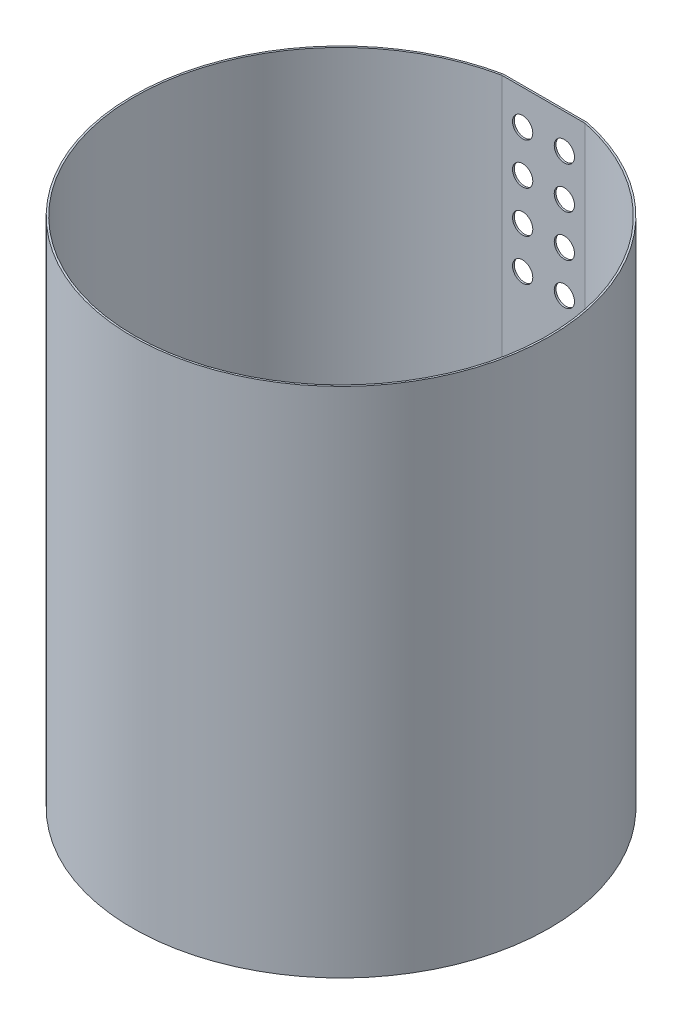
ISO-10303-21;
HEADER;
FILE_DESCRIPTION(('STEP AP214'),'2;1');
FILE_NAME('part.step','',(''),(''),'','','');
FILE_SCHEMA(('AUTOMOTIVE_DESIGN { 1 0 10303 214 1 1 1 1 }'));
ENDSEC;
DATA;
#1=APPLICATION_CONTEXT('core data for automotive mechanical design processes');
#2=APPLICATION_PROTOCOL_DEFINITION('international standard','automotive_design',2000,#1);
#3=PRODUCT_CONTEXT('',#1,'mechanical');
#4=PRODUCT('Part','Part','',(#3));
#5=PRODUCT_RELATED_PRODUCT_CATEGORY('part','',(#4));
#6=PRODUCT_DEFINITION_FORMATION('','',#4);
#7=PRODUCT_DEFINITION_CONTEXT('part definition',#1,'design');
#8=PRODUCT_DEFINITION('design','',#6,#7);
#9=PRODUCT_DEFINITION_SHAPE('','',#8);
#10=(LENGTH_UNIT() NAMED_UNIT(*) SI_UNIT(.MILLI.,.METRE.));
#11=(NAMED_UNIT(*) PLANE_ANGLE_UNIT() SI_UNIT($,.RADIAN.));
#12=(NAMED_UNIT(*) SI_UNIT($,.STERADIAN.) SOLID_ANGLE_UNIT());
#13=UNCERTAINTY_MEASURE_WITH_UNIT(LENGTH_MEASURE(1.E-05),#10,'distance_accuracy_value','');
#14=(GEOMETRIC_REPRESENTATION_CONTEXT(3) GLOBAL_UNCERTAINTY_ASSIGNED_CONTEXT((#13)) GLOBAL_UNIT_ASSIGNED_CONTEXT((#10,
#11,#12)) REPRESENTATION_CONTEXT('',''));
#15=CARTESIAN_POINT('',(0.,0.,0.));
#16=DIRECTION('',(0.,0.,1.));
#17=DIRECTION('',(1.,0.,0.));
#18=AXIS2_PLACEMENT_3D('',#15,#16,#17);
#19=CARTESIAN_POINT('',(0.,430.,-171.43307506192));
#20=DIRECTION('',(0.,0.,-1.));
#21=DIRECTION('',(-1.,0.,0.));
#22=AXIS2_PLACEMENT_3D('',#19,#20,#21);
#23=PLANE('',#22);
#24=CARTESIAN_POINT('',(17.5,296.,-171.43307506192));
#25=DIRECTION('',(0.,0.,-1.));
#26=DIRECTION('',(-1.,0.,0.));
#27=AXIS2_PLACEMENT_3D('',#24,#25,#26);
#28=CIRCLE('',#27,8.50000000000002);
#29=CARTESIAN_POINT('',(8.99999999999998,296.,-171.43307506192));
#30=VERTEX_POINT('',#29);
#31=EDGE_CURVE('E191',#30,#30,#28,.T.);
#32=ORIENTED_EDGE('',*,*,#31,.F.);
#33=EDGE_LOOP('',(#32));
#34=FACE_BOUND('',#33,.T.);
#35=CARTESIAN_POINT('',(-17.5,331.,-171.43307506192));
#36=DIRECTION('',(0.,0.,-1.));
#37=DIRECTION('',(1.,0.,0.));
#38=AXIS2_PLACEMENT_3D('',#35,#36,#37);
#39=CIRCLE('',#38,8.50000000000002);
#40=CARTESIAN_POINT('',(-8.99999999999999,331.,-171.43307506192));
#41=VERTEX_POINT('',#40);
#42=EDGE_CURVE('E195',#41,#41,#39,.T.);
#43=ORIENTED_EDGE('',*,*,#42,.F.);
#44=EDGE_LOOP('',(#43));
#45=FACE_BOUND('',#44,.T.);
#46=CARTESIAN_POINT('',(17.5,331.,-171.43307506192));
#47=DIRECTION('',(0.,0.,-1.));
#48=DIRECTION('',(-1.,0.,0.));
#49=AXIS2_PLACEMENT_3D('',#46,#47,#48);
#50=CIRCLE('',#49,8.50000000000002);
#51=CARTESIAN_POINT('',(8.99999999999998,331.,-171.43307506192));
#52=VERTEX_POINT('',#51);
#53=EDGE_CURVE('E183',#52,#52,#50,.T.);
#54=ORIENTED_EDGE('',*,*,#53,.F.);
#55=EDGE_LOOP('',(#54));
#56=FACE_BOUND('',#55,.T.);
#57=CARTESIAN_POINT('',(-17.5,366.,-171.43307506192));
#58=DIRECTION('',(0.,0.,-1.));
#59=DIRECTION('',(1.,0.,0.));
#60=AXIS2_PLACEMENT_3D('',#57,#58,#59);
#61=CIRCLE('',#60,8.50000000000002);
#62=CARTESIAN_POINT('',(-8.99999999999999,366.,-171.43307506192));
#63=VERTEX_POINT('',#62);
#64=EDGE_CURVE('E187',#63,#63,#61,.T.);
#65=ORIENTED_EDGE('',*,*,#64,.F.);
#66=EDGE_LOOP('',(#65));
#67=FACE_BOUND('',#66,.T.);
#68=CARTESIAN_POINT('',(-17.5,296.,-171.43307506192));
#69=DIRECTION('',(0.,0.,-1.));
#70=DIRECTION('',(1.,0.,0.));
#71=AXIS2_PLACEMENT_3D('',#68,#69,#70);
#72=CIRCLE('',#71,8.50000000000002);
#73=CARTESIAN_POINT('',(-8.99999999999999,296.,-171.43307506192));
#74=VERTEX_POINT('',#73);
#75=EDGE_CURVE('E199',#74,#74,#72,.T.);
#76=ORIENTED_EDGE('',*,*,#75,.F.);
#77=EDGE_LOOP('',(#76));
#78=FACE_BOUND('',#77,.T.);
#79=CARTESIAN_POINT('',(17.5,366.,-171.43307506192));
#80=DIRECTION('',(0.,0.,-1.));
#81=DIRECTION('',(-1.,0.,0.));
#82=AXIS2_PLACEMENT_3D('',#79,#80,#81);
#83=CIRCLE('',#82,8.50000000000002);
#84=CARTESIAN_POINT('',(8.99999999999998,366.,-171.43307506192));
#85=VERTEX_POINT('',#84);
#86=EDGE_CURVE('E179',#85,#85,#83,.T.);
#87=ORIENTED_EDGE('',*,*,#86,.F.);
#88=EDGE_LOOP('',(#87));
#89=FACE_BOUND('',#88,.T.);
#90=CARTESIAN_POINT('',(17.5,401.,-171.43307506192));
#91=DIRECTION('',(0.,0.,-1.));
#92=DIRECTION('',(-1.,0.,0.));
#93=AXIS2_PLACEMENT_3D('',#90,#91,#92);
#94=CIRCLE('',#93,8.50000000000002);
#95=CARTESIAN_POINT('',(8.99999999999998,401.,-171.43307506192));
#96=VERTEX_POINT('',#95);
#97=EDGE_CURVE('E173',#96,#96,#94,.T.);
#98=ORIENTED_EDGE('',*,*,#97,.F.);
#99=EDGE_LOOP('',(#98));
#100=FACE_BOUND('',#99,.T.);
#101=CARTESIAN_POINT('',(-17.5,401.,-171.43307506192));
#102=DIRECTION('',(0.,0.,-1.));
#103=DIRECTION('',(1.,0.,0.));
#104=AXIS2_PLACEMENT_3D('',#101,#102,#103);
#105=CIRCLE('',#104,8.50000000000002);
#106=CARTESIAN_POINT('',(-8.99999999999999,401.,-171.43307506192));
#107=VERTEX_POINT('',#106);
#108=EDGE_CURVE('E105',#107,#107,#105,.T.);
#109=ORIENTED_EDGE('',*,*,#108,.F.);
#110=EDGE_LOOP('',(#109));
#111=FACE_BOUND('',#110,.T.);
#112=DIRECTION('',(1.,0.,0.));
#113=VECTOR('',#112,1.);
#114=CARTESIAN_POINT('',(0.,0.,-171.43307506192));
#115=LINE('',#114,#113);
#116=CARTESIAN_POINT('',(-35.1525358233832,0.,-171.43307506192));
#117=VERTEX_POINT('',#116);
#118=CARTESIAN_POINT('',(35.1525358233832,0.,-171.43307506192));
#119=VERTEX_POINT('',#118);
#120=EDGE_CURVE('E102',#117,#119,#115,.T.);
#121=ORIENTED_EDGE('',*,*,#120,.F.);
#122=DIRECTION('',(0.,-1.,0.));
#123=VECTOR('',#122,1.);
#124=CARTESIAN_POINT('',(-35.1525358233832,430.,-171.43307506192));
#125=LINE('',#124,#123);
#126=CARTESIAN_POINT('',(-35.1525358233832,430.,-171.43307506192));
#127=VERTEX_POINT('',#126);
#128=EDGE_CURVE('E11',#127,#117,#125,.T.);
#129=ORIENTED_EDGE('',*,*,#128,.F.);
#130=DIRECTION('',(1.,0.,0.));
#131=VECTOR('',#130,1.);
#132=CARTESIAN_POINT('',(0.,430.,-171.43307506192));
#133=LINE('',#132,#131);
#134=CARTESIAN_POINT('',(35.1525358233832,430.,-171.43307506192));
#135=VERTEX_POINT('',#134);
#136=EDGE_CURVE('E92',#127,#135,#133,.T.);
#137=ORIENTED_EDGE('',*,*,#136,.T.);
#138=DIRECTION('',(0.,-1.,0.));
#139=VECTOR('',#138,1.);
#140=CARTESIAN_POINT('',(35.1525358233832,430.,-171.43307506192));
#141=LINE('',#140,#139);
#142=EDGE_CURVE('E49',#135,#119,#141,.T.);
#143=ORIENTED_EDGE('',*,*,#142,.T.);
#144=EDGE_LOOP('',(#121,#129,#137,#143));
#145=FACE_BOUND('',#144,.T.);
#146=ADVANCED_FACE('F39',(#34,#45,#56,#67,#78,#89,#100,#111,#145),#23,.T.);
#147=CARTESIAN_POINT('',(0.,430.,0.));
#148=DIRECTION('',(0.,-1.,0.));
#149=DIRECTION('',(0.,0.,-1.));
#150=AXIS2_PLACEMENT_3D('',#147,#148,#149);
#151=CYLINDRICAL_SURFACE('',#150,173.5);
#152=CARTESIAN_POINT('',(0.,0.,0.));
#153=DIRECTION('',(0.,1.,0.));
#154=DIRECTION('',(0.,0.,1.));
#155=AXIS2_PLACEMENT_3D('',#152,#153,#154);
#156=CIRCLE('',#155,173.5);
#157=CARTESIAN_POINT('',(-35.,0.,-169.93307506192));
#158=VERTEX_POINT('',#157);
#159=CARTESIAN_POINT('',(35.,0.,-169.93307506192));
#160=VERTEX_POINT('',#159);
#161=EDGE_CURVE('E110',#158,#160,#156,.T.);
#162=ORIENTED_EDGE('',*,*,#161,.F.);
#163=DIRECTION('',(0.,-1.,0.));
#164=VECTOR('',#163,1.);
#165=CARTESIAN_POINT('',(-35.,430.,-169.93307506192));
#166=LINE('',#165,#164);
#167=CARTESIAN_POINT('',(-35.,430.,-169.93307506192));
#168=VERTEX_POINT('',#167);
#169=EDGE_CURVE('E43',#168,#158,#166,.T.);
#170=ORIENTED_EDGE('',*,*,#169,.F.);
#171=CARTESIAN_POINT('',(0.,430.,0.));
#172=DIRECTION('',(0.,1.,0.));
#173=DIRECTION('',(0.,0.,1.));
#174=AXIS2_PLACEMENT_3D('',#171,#172,#173);
#175=CIRCLE('',#174,173.5);
#176=CARTESIAN_POINT('',(35.,430.,-169.93307506192));
#177=VERTEX_POINT('',#176);
#178=EDGE_CURVE('E90',#168,#177,#175,.T.);
#179=ORIENTED_EDGE('',*,*,#178,.T.);
#180=DIRECTION('',(0.,-1.,0.));
#181=VECTOR('',#180,1.);
#182=CARTESIAN_POINT('',(35.,430.,-169.93307506192));
#183=LINE('',#182,#181);
#184=EDGE_CURVE('E95',#177,#160,#183,.T.);
#185=ORIENTED_EDGE('',*,*,#184,.T.);
#186=EDGE_LOOP('',(#162,#170,#179,#185));
#187=FACE_BOUND('',#186,.T.);
#188=ADVANCED_FACE('F41',(#187),#151,.F.);
#189=CARTESIAN_POINT('',(0.,430.,-169.93307506192));
#190=DIRECTION('',(0.,0.,-1.));
#191=DIRECTION('',(-1.,0.,0.));
#192=AXIS2_PLACEMENT_3D('',#189,#190,#191);
#193=PLANE('',#192);
#194=CARTESIAN_POINT('',(17.5,296.,-169.93307506192));
#195=DIRECTION('',(0.,0.,-1.));
#196=DIRECTION('',(-1.,0.,0.));
#197=AXIS2_PLACEMENT_3D('',#194,#195,#196);
#198=CIRCLE('',#197,8.50000000000002);
#199=CARTESIAN_POINT('',(8.99999999999998,296.,-169.93307506192));
#200=VERTEX_POINT('',#199);
#201=EDGE_CURVE('E145',#200,#200,#198,.T.);
#202=ORIENTED_EDGE('',*,*,#201,.T.);
#203=EDGE_LOOP('',(#202));
#204=FACE_BOUND('',#203,.T.);
#205=CARTESIAN_POINT('',(-17.5,331.,-169.93307506192));
#206=DIRECTION('',(0.,0.,-1.));
#207=DIRECTION('',(1.,0.,0.));
#208=AXIS2_PLACEMENT_3D('',#205,#206,#207);
#209=CIRCLE('',#208,8.50000000000002);
#210=CARTESIAN_POINT('',(-8.99999999999999,331.,-169.93307506192));
#211=VERTEX_POINT('',#210);
#212=EDGE_CURVE('E149',#211,#211,#209,.T.);
#213=ORIENTED_EDGE('',*,*,#212,.T.);
#214=EDGE_LOOP('',(#213));
#215=FACE_BOUND('',#214,.T.);
#216=CARTESIAN_POINT('',(17.5,331.,-169.93307506192));
#217=DIRECTION('',(0.,0.,-1.));
#218=DIRECTION('',(-1.,0.,0.));
#219=AXIS2_PLACEMENT_3D('',#216,#217,#218);
#220=CIRCLE('',#219,8.50000000000002);
#221=CARTESIAN_POINT('',(8.99999999999998,331.,-169.93307506192));
#222=VERTEX_POINT('',#221);
#223=EDGE_CURVE('E153',#222,#222,#220,.T.);
#224=ORIENTED_EDGE('',*,*,#223,.T.);
#225=EDGE_LOOP('',(#224));
#226=FACE_BOUND('',#225,.T.);
#227=CARTESIAN_POINT('',(-17.5,366.,-169.93307506192));
#228=DIRECTION('',(0.,0.,-1.));
#229=DIRECTION('',(1.,0.,0.));
#230=AXIS2_PLACEMENT_3D('',#227,#228,#229);
#231=CIRCLE('',#230,8.50000000000002);
#232=CARTESIAN_POINT('',(-8.99999999999999,366.,-169.93307506192));
#233=VERTEX_POINT('',#232);
#234=EDGE_CURVE('E157',#233,#233,#231,.T.);
#235=ORIENTED_EDGE('',*,*,#234,.T.);
#236=EDGE_LOOP('',(#235));
#237=FACE_BOUND('',#236,.T.);
#238=CARTESIAN_POINT('',(-17.5,296.,-169.93307506192));
#239=DIRECTION('',(0.,0.,-1.));
#240=DIRECTION('',(1.,0.,0.));
#241=AXIS2_PLACEMENT_3D('',#238,#239,#240);
#242=CIRCLE('',#241,8.50000000000002);
#243=CARTESIAN_POINT('',(-8.99999999999999,296.,-169.93307506192));
#244=VERTEX_POINT('',#243);
#245=EDGE_CURVE('E161',#244,#244,#242,.T.);
#246=ORIENTED_EDGE('',*,*,#245,.T.);
#247=EDGE_LOOP('',(#246));
#248=FACE_BOUND('',#247,.T.);
#249=CARTESIAN_POINT('',(17.5,366.,-169.93307506192));
#250=DIRECTION('',(0.,0.,-1.));
#251=DIRECTION('',(-1.,0.,0.));
#252=AXIS2_PLACEMENT_3D('',#249,#250,#251);
#253=CIRCLE('',#252,8.50000000000002);
#254=CARTESIAN_POINT('',(8.99999999999998,366.,-169.93307506192));
#255=VERTEX_POINT('',#254);
#256=EDGE_CURVE('E165',#255,#255,#253,.T.);
#257=ORIENTED_EDGE('',*,*,#256,.T.);
#258=EDGE_LOOP('',(#257));
#259=FACE_BOUND('',#258,.T.);
#260=CARTESIAN_POINT('',(17.5,401.,-169.93307506192));
#261=DIRECTION('',(0.,0.,-1.));
#262=DIRECTION('',(-1.,0.,0.));
#263=AXIS2_PLACEMENT_3D('',#260,#261,#262);
#264=CIRCLE('',#263,8.50000000000002);
#265=CARTESIAN_POINT('',(8.99999999999998,401.,-169.93307506192));
#266=VERTEX_POINT('',#265);
#267=EDGE_CURVE('E112',#266,#266,#264,.T.);
#268=ORIENTED_EDGE('',*,*,#267,.T.);
#269=EDGE_LOOP('',(#268));
#270=FACE_BOUND('',#269,.T.);
#271=CARTESIAN_POINT('',(-17.5,401.,-169.93307506192));
#272=DIRECTION('',(0.,0.,-1.));
#273=DIRECTION('',(1.,0.,0.));
#274=AXIS2_PLACEMENT_3D('',#271,#272,#273);
#275=CIRCLE('',#274,8.50000000000002);
#276=CARTESIAN_POINT('',(-8.99999999999999,401.,-169.93307506192));
#277=VERTEX_POINT('',#276);
#278=EDGE_CURVE('E171',#277,#277,#275,.T.);
#279=ORIENTED_EDGE('',*,*,#278,.T.);
#280=EDGE_LOOP('',(#279));
#281=FACE_BOUND('',#280,.T.);
#282=DIRECTION('',(1.,0.,0.));
#283=VECTOR('',#282,1.);
#284=CARTESIAN_POINT('',(0.,0.,-169.93307506192));
#285=LINE('',#284,#283);
#286=EDGE_CURVE('E98',#158,#160,#285,.T.);
#287=ORIENTED_EDGE('',*,*,#286,.T.);
#288=ORIENTED_EDGE('',*,*,#184,.F.);
#289=DIRECTION('',(1.,0.,0.));
#290=VECTOR('',#289,1.);
#291=CARTESIAN_POINT('',(0.,430.,-169.93307506192));
#292=LINE('',#291,#290);
#293=EDGE_CURVE('E87',#168,#177,#292,.T.);
#294=ORIENTED_EDGE('',*,*,#293,.F.);
#295=ORIENTED_EDGE('',*,*,#169,.T.);
#296=EDGE_LOOP('',(#287,#288,#294,#295));
#297=FACE_BOUND('',#296,.T.);
#298=ADVANCED_FACE('F96',(#204,#215,#226,#237,#248,#259,#270,#281,#297),#193,.F.);
#299=CARTESIAN_POINT('',(0.,430.,0.));
#300=DIRECTION('',(0.,-1.,0.));
#301=DIRECTION('',(0.,0.,-1.));
#302=AXIS2_PLACEMENT_3D('',#299,#300,#301);
#303=CYLINDRICAL_SURFACE('',#302,175.);
#304=CARTESIAN_POINT('',(0.,0.,0.));
#305=DIRECTION('',(0.,1.,0.));
#306=DIRECTION('',(0.,0.,1.));
#307=AXIS2_PLACEMENT_3D('',#304,#305,#306);
#308=CIRCLE('',#307,175.);
#309=EDGE_CURVE('E100',#117,#119,#308,.T.);
#310=ORIENTED_EDGE('',*,*,#309,.T.);
#311=ORIENTED_EDGE('',*,*,#142,.F.);
#312=CARTESIAN_POINT('',(0.,430.,0.));
#313=DIRECTION('',(0.,1.,0.));
#314=DIRECTION('',(0.,0.,1.));
#315=AXIS2_PLACEMENT_3D('',#312,#313,#314);
#316=CIRCLE('',#315,175.);
#317=EDGE_CURVE('E57',#127,#135,#316,.T.);
#318=ORIENTED_EDGE('',*,*,#317,.F.);
#319=ORIENTED_EDGE('',*,*,#128,.T.);
#320=EDGE_LOOP('',(#310,#311,#318,#319));
#321=FACE_BOUND('',#320,.T.);
#322=ADVANCED_FACE('F122',(#321),#303,.T.);
#323=CARTESIAN_POINT('',(0.,430.,0.));
#324=DIRECTION('',(0.,1.,0.));
#325=DIRECTION('',(0.,0.,1.));
#326=AXIS2_PLACEMENT_3D('',#323,#324,#325);
#327=PLANE('',#326);
#328=ORIENTED_EDGE('',*,*,#178,.F.);
#329=ORIENTED_EDGE('',*,*,#293,.T.);
#330=EDGE_LOOP('',(#328,#329));
#331=FACE_BOUND('',#330,.T.);
#332=ORIENTED_EDGE('',*,*,#136,.F.);
#333=ORIENTED_EDGE('',*,*,#317,.T.);
#334=EDGE_LOOP('',(#332,#333));
#335=FACE_BOUND('',#334,.T.);
#336=ADVANCED_FACE('F89',(#331,#335),#327,.T.);
#337=CARTESIAN_POINT('',(0.,0.,0.));
#338=DIRECTION('',(0.,1.,0.));
#339=DIRECTION('',(0.,0.,1.));
#340=AXIS2_PLACEMENT_3D('',#337,#338,#339);
#341=PLANE('',#340);
#342=ORIENTED_EDGE('',*,*,#161,.T.);
#343=ORIENTED_EDGE('',*,*,#286,.F.);
#344=EDGE_LOOP('',(#342,#343));
#345=FACE_BOUND('',#344,.T.);
#346=ORIENTED_EDGE('',*,*,#120,.T.);
#347=ORIENTED_EDGE('',*,*,#309,.F.);
#348=EDGE_LOOP('',(#346,#347));
#349=FACE_BOUND('',#348,.T.);
#350=ADVANCED_FACE('F117',(#345,#349),#341,.F.);
#351=CARTESIAN_POINT('',(-17.5,401.,-169.93307506192));
#352=DIRECTION('',(0.,0.,-1.));
#353=DIRECTION('',(-1.,0.,0.));
#354=AXIS2_PLACEMENT_3D('',#351,#352,#353);
#355=CYLINDRICAL_SURFACE('',#354,8.50000000000002);
#356=ORIENTED_EDGE('',*,*,#278,.F.);
#357=EDGE_LOOP('',(#356));
#358=FACE_BOUND('',#357,.T.);
#359=ORIENTED_EDGE('',*,*,#108,.T.);
#360=EDGE_LOOP('',(#359));
#361=FACE_BOUND('',#360,.T.);
#362=ADVANCED_FACE('F120',(#358,#361),#355,.F.);
#363=CARTESIAN_POINT('',(17.5,401.,-169.93307506192));
#364=DIRECTION('',(0.,0.,-1.));
#365=DIRECTION('',(-1.,0.,0.));
#366=AXIS2_PLACEMENT_3D('',#363,#364,#365);
#367=CYLINDRICAL_SURFACE('',#366,8.50000000000002);
#368=ORIENTED_EDGE('',*,*,#267,.F.);
#369=EDGE_LOOP('',(#368));
#370=FACE_BOUND('',#369,.T.);
#371=ORIENTED_EDGE('',*,*,#97,.T.);
#372=EDGE_LOOP('',(#371));
#373=FACE_BOUND('',#372,.T.);
#374=ADVANCED_FACE('F214',(#370,#373),#367,.F.);
#375=CARTESIAN_POINT('',(17.5,366.,-169.93307506192));
#376=DIRECTION('',(0.,0.,-1.));
#377=DIRECTION('',(-1.,0.,0.));
#378=AXIS2_PLACEMENT_3D('',#375,#376,#377);
#379=CYLINDRICAL_SURFACE('',#378,8.50000000000002);
#380=ORIENTED_EDGE('',*,*,#256,.F.);
#381=EDGE_LOOP('',(#380));
#382=FACE_BOUND('',#381,.T.);
#383=ORIENTED_EDGE('',*,*,#86,.T.);
#384=EDGE_LOOP('',(#383));
#385=FACE_BOUND('',#384,.T.);
#386=ADVANCED_FACE('F218',(#382,#385),#379,.F.);
#387=CARTESIAN_POINT('',(-17.5,296.,-169.93307506192));
#388=DIRECTION('',(0.,0.,-1.));
#389=DIRECTION('',(-1.,0.,0.));
#390=AXIS2_PLACEMENT_3D('',#387,#388,#389);
#391=CYLINDRICAL_SURFACE('',#390,8.50000000000002);
#392=ORIENTED_EDGE('',*,*,#245,.F.);
#393=EDGE_LOOP('',(#392));
#394=FACE_BOUND('',#393,.T.);
#395=ORIENTED_EDGE('',*,*,#75,.T.);
#396=EDGE_LOOP('',(#395));
#397=FACE_BOUND('',#396,.T.);
#398=ADVANCED_FACE('F204',(#394,#397),#391,.F.);
#399=CARTESIAN_POINT('',(-17.5,366.,-169.93307506192));
#400=DIRECTION('',(0.,0.,-1.));
#401=DIRECTION('',(-1.,0.,0.));
#402=AXIS2_PLACEMENT_3D('',#399,#400,#401);
#403=CYLINDRICAL_SURFACE('',#402,8.50000000000002);
#404=ORIENTED_EDGE('',*,*,#234,.F.);
#405=EDGE_LOOP('',(#404));
#406=FACE_BOUND('',#405,.T.);
#407=ORIENTED_EDGE('',*,*,#64,.T.);
#408=EDGE_LOOP('',(#407));
#409=FACE_BOUND('',#408,.T.);
#410=ADVANCED_FACE('F229',(#406,#409),#403,.F.);
#411=CARTESIAN_POINT('',(17.5,331.,-169.93307506192));
#412=DIRECTION('',(0.,0.,-1.));
#413=DIRECTION('',(-1.,0.,0.));
#414=AXIS2_PLACEMENT_3D('',#411,#412,#413);
#415=CYLINDRICAL_SURFACE('',#414,8.50000000000002);
#416=ORIENTED_EDGE('',*,*,#223,.F.);
#417=EDGE_LOOP('',(#416));
#418=FACE_BOUND('',#417,.T.);
#419=ORIENTED_EDGE('',*,*,#53,.T.);
#420=EDGE_LOOP('',(#419));
#421=FACE_BOUND('',#420,.T.);
#422=ADVANCED_FACE('F225',(#418,#421),#415,.F.);
#423=CARTESIAN_POINT('',(-17.5,331.,-169.93307506192));
#424=DIRECTION('',(0.,0.,-1.));
#425=DIRECTION('',(-1.,0.,0.));
#426=AXIS2_PLACEMENT_3D('',#423,#424,#425);
#427=CYLINDRICAL_SURFACE('',#426,8.50000000000002);
#428=ORIENTED_EDGE('',*,*,#212,.F.);
#429=EDGE_LOOP('',(#428));
#430=FACE_BOUND('',#429,.T.);
#431=ORIENTED_EDGE('',*,*,#42,.T.);
#432=EDGE_LOOP('',(#431));
#433=FACE_BOUND('',#432,.T.);
#434=ADVANCED_FACE('F228',(#430,#433),#427,.F.);
#435=CARTESIAN_POINT('',(17.5,296.,-169.93307506192));
#436=DIRECTION('',(0.,0.,-1.));
#437=DIRECTION('',(-1.,0.,0.));
#438=AXIS2_PLACEMENT_3D('',#435,#436,#437);
#439=CYLINDRICAL_SURFACE('',#438,8.50000000000002);
#440=ORIENTED_EDGE('',*,*,#201,.F.);
#441=EDGE_LOOP('',(#440));
#442=FACE_BOUND('',#441,.T.);
#443=ORIENTED_EDGE('',*,*,#31,.T.);
#444=EDGE_LOOP('',(#443));
#445=FACE_BOUND('',#444,.T.);
#446=ADVANCED_FACE('F234',(#442,#445),#439,.F.);
#447=CLOSED_SHELL('',(#146,#188,#298,#322,#336,#350,#362,#374,#386,#398,#410,#422,#434,#446));
#448=MANIFOLD_SOLID_BREP('B2',#447);
#449=ADVANCED_BREP_SHAPE_REPRESENTATION('',(#18,#448),#14);
#450=SHAPE_DEFINITION_REPRESENTATION(#9,#449);
ENDSEC;
END-ISO-10303-21;
